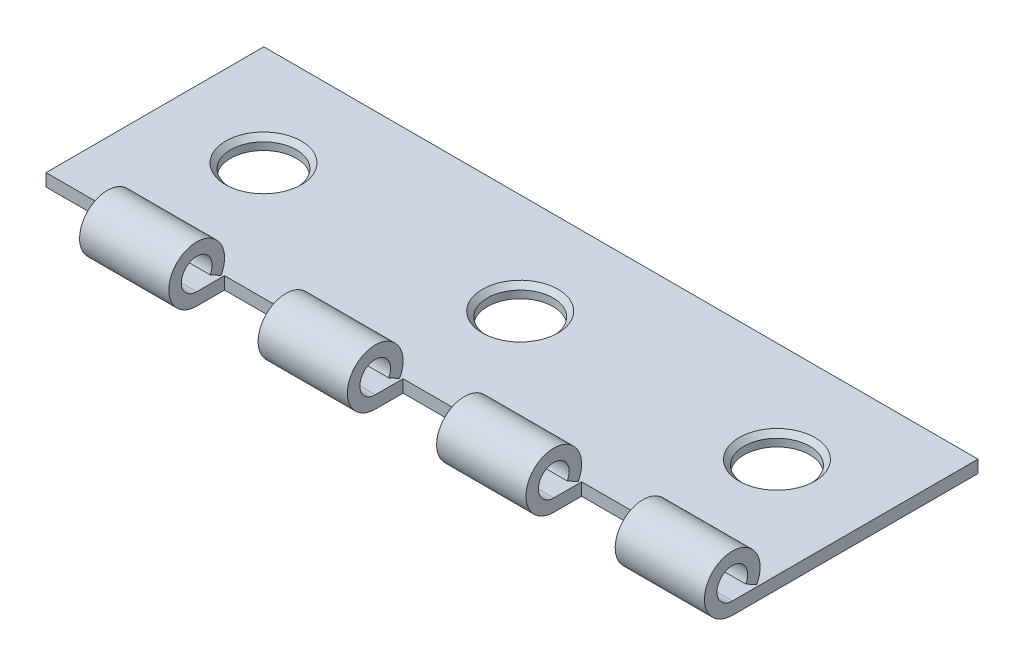
ISO-10303-21;
HEADER;
FILE_DESCRIPTION(('STEP AP214'),'2;1');
FILE_NAME('part.step','',(''),(''),'','','');
FILE_SCHEMA(('AUTOMOTIVE_DESIGN { 1 0 10303 214 1 1 1 1 }'));
ENDSEC;
DATA;
#1=APPLICATION_CONTEXT('core data for automotive mechanical design processes');
#2=APPLICATION_PROTOCOL_DEFINITION('international standard','automotive_design',2000,#1);
#3=PRODUCT_CONTEXT('',#1,'mechanical');
#4=PRODUCT('Part','Part','',(#3));
#5=PRODUCT_RELATED_PRODUCT_CATEGORY('part','',(#4));
#6=PRODUCT_DEFINITION_FORMATION('','',#4);
#7=PRODUCT_DEFINITION_CONTEXT('part definition',#1,'design');
#8=PRODUCT_DEFINITION('design','',#6,#7);
#9=PRODUCT_DEFINITION_SHAPE('','',#8);
#10=(LENGTH_UNIT() NAMED_UNIT(*) SI_UNIT(.MILLI.,.METRE.));
#11=(NAMED_UNIT(*) PLANE_ANGLE_UNIT() SI_UNIT($,.RADIAN.));
#12=(NAMED_UNIT(*) SI_UNIT($,.STERADIAN.) SOLID_ANGLE_UNIT());
#13=UNCERTAINTY_MEASURE_WITH_UNIT(LENGTH_MEASURE(1.E-05),#10,'distance_accuracy_value','');
#14=(GEOMETRIC_REPRESENTATION_CONTEXT(3) GLOBAL_UNCERTAINTY_ASSIGNED_CONTEXT((#13)) GLOBAL_UNIT_ASSIGNED_CONTEXT((#10,
#11,#12)) REPRESENTATION_CONTEXT('',''));
#15=CARTESIAN_POINT('',(0.,0.,0.));
#16=DIRECTION('',(0.,0.,1.));
#17=DIRECTION('',(1.,0.,0.));
#18=AXIS2_PLACEMENT_3D('',#15,#16,#17);
#19=CARTESIAN_POINT('',(-25.4,0.,0.));
#20=DIRECTION('',(1.,0.,0.));
#21=DIRECTION('',(0.,0.,-1.));
#22=AXIS2_PLACEMENT_3D('',#19,#20,#21);
#23=CYLINDRICAL_SURFACE('',#22,1.0922);
#24=DIRECTION('',(1.,0.,0.));
#25=VECTOR('',#24,1.);
#26=CARTESIAN_POINT('',(-25.4,-0.527292872124992,-0.95648474478487));
#27=LINE('',#26,#25);
#28=CARTESIAN_POINT('',(-6.35,-0.527292872124992,-0.95648474478487));
#29=VERTEX_POINT('',#28);
#30=CARTESIAN_POINT('',(0.,-0.527292872124992,-0.95648474478487));
#31=VERTEX_POINT('',#30);
#32=EDGE_CURVE('E379',#29,#31,#27,.T.);
#33=ORIENTED_EDGE('',*,*,#32,.T.);
#34=CARTESIAN_POINT('',(0.,0.,0.));
#35=DIRECTION('',(-1.,0.,0.));
#36=DIRECTION('',(0.,0.,1.));
#37=AXIS2_PLACEMENT_3D('',#34,#35,#36);
#38=CIRCLE('',#37,1.0922);
#39=CARTESIAN_POINT('',(0.,-1.0922,0.));
#40=VERTEX_POINT('',#39);
#41=EDGE_CURVE('E311',#31,#40,#38,.F.);
#42=ORIENTED_EDGE('',*,*,#41,.T.);
#43=DIRECTION('',(1.,0.,0.));
#44=VECTOR('',#43,1.);
#45=CARTESIAN_POINT('',(-25.4,-1.0922,0.));
#46=LINE('',#45,#44);
#47=CARTESIAN_POINT('',(-6.35,-1.0922,0.));
#48=VERTEX_POINT('',#47);
#49=EDGE_CURVE('E398',#48,#40,#46,.T.);
#50=ORIENTED_EDGE('',*,*,#49,.F.);
#51=CARTESIAN_POINT('',(-6.35,0.,0.));
#52=DIRECTION('',(1.,0.,0.));
#53=DIRECTION('',(0.,0.,-1.));
#54=AXIS2_PLACEMENT_3D('',#51,#52,#53);
#55=CIRCLE('',#54,1.0922);
#56=EDGE_CURVE('E275',#48,#29,#55,.F.);
#57=ORIENTED_EDGE('',*,*,#56,.T.);
#58=EDGE_LOOP('',(#33,#42,#50,#57));
#59=FACE_BOUND('',#58,.T.);
#60=ADVANCED_FACE('F36',(#59),#23,.F.);
#61=CARTESIAN_POINT('',(-19.05,-0.527292872124992,-0.95648474478487));
#62=VERTEX_POINT('',#61);
#63=CARTESIAN_POINT('',(-12.7,-0.527292872124992,-0.95648474478487));
#64=VERTEX_POINT('',#63);
#65=EDGE_CURVE('E477',#62,#64,#27,.T.);
#66=ORIENTED_EDGE('',*,*,#65,.T.);
#67=CARTESIAN_POINT('',(-12.7,0.,0.));
#68=DIRECTION('',(-1.,0.,0.));
#69=DIRECTION('',(0.,0.,1.));
#70=AXIS2_PLACEMENT_3D('',#67,#68,#69);
#71=CIRCLE('',#70,1.0922);
#72=CARTESIAN_POINT('',(-12.7,-1.0922,0.));
#73=VERTEX_POINT('',#72);
#74=EDGE_CURVE('E289',#64,#73,#71,.F.);
#75=ORIENTED_EDGE('',*,*,#74,.T.);
#76=CARTESIAN_POINT('',(-19.05,-1.0922,0.));
#77=VERTEX_POINT('',#76);
#78=EDGE_CURVE('E403',#77,#73,#46,.T.);
#79=ORIENTED_EDGE('',*,*,#78,.F.);
#80=CARTESIAN_POINT('',(-19.05,0.,0.));
#81=DIRECTION('',(1.,0.,0.));
#82=DIRECTION('',(0.,0.,-1.));
#83=AXIS2_PLACEMENT_3D('',#80,#81,#82);
#84=CIRCLE('',#83,1.0922);
#85=EDGE_CURVE('E264',#77,#62,#84,.F.);
#86=ORIENTED_EDGE('',*,*,#85,.T.);
#87=EDGE_LOOP('',(#66,#75,#79,#86));
#88=FACE_BOUND('',#87,.T.);
#89=ADVANCED_FACE('F503',(#88),#23,.F.);
#90=CARTESIAN_POINT('',(-25.4,0.,0.));
#91=DIRECTION('',(1.,0.,0.));
#92=DIRECTION('',(0.,0.,-1.));
#93=AXIS2_PLACEMENT_3D('',#90,#91,#92);
#94=CYLINDRICAL_SURFACE('',#93,1.98120000000008);
#95=CARTESIAN_POINT('',(0.,0.,0.));
#96=DIRECTION('',(-1.,0.,0.));
#97=DIRECTION('',(0.,0.,1.));
#98=AXIS2_PLACEMENT_3D('',#95,#96,#97);
#99=CIRCLE('',#98,1.98120000000008);
#100=CARTESIAN_POINT('',(0.,-1.9812,0.));
#101=VERTEX_POINT('',#100);
#102=CARTESIAN_POINT('',(0.,-0.956484744784868,-1.73501883937721));
#103=VERTEX_POINT('',#102);
#104=EDGE_CURVE('E225',#101,#103,#99,.T.);
#105=ORIENTED_EDGE('',*,*,#104,.T.);
#106=DIRECTION('',(1.,0.,0.));
#107=VECTOR('',#106,1.);
#108=CARTESIAN_POINT('',(-25.4,-0.956484744784868,-1.73501883937721));
#109=LINE('',#108,#107);
#110=CARTESIAN_POINT('',(-6.35,-0.956484744784868,-1.73501883937721));
#111=VERTEX_POINT('',#110);
#112=EDGE_CURVE('E382',#111,#103,#109,.T.);
#113=ORIENTED_EDGE('',*,*,#112,.F.);
#114=CARTESIAN_POINT('',(-6.35,0.,0.));
#115=DIRECTION('',(1.,0.,0.));
#116=DIRECTION('',(0.,0.,-1.));
#117=AXIS2_PLACEMENT_3D('',#114,#115,#116);
#118=CIRCLE('',#117,1.98120000000008);
#119=CARTESIAN_POINT('',(-6.35,-1.9812,0.));
#120=VERTEX_POINT('',#119);
#121=EDGE_CURVE('E281',#111,#120,#118,.T.);
#122=ORIENTED_EDGE('',*,*,#121,.T.);
#123=DIRECTION('',(1.,0.,0.));
#124=VECTOR('',#123,1.);
#125=CARTESIAN_POINT('',(-25.4,-1.9812,0.));
#126=LINE('',#125,#124);
#127=EDGE_CURVE('E386',#120,#101,#126,.T.);
#128=ORIENTED_EDGE('',*,*,#127,.T.);
#129=EDGE_LOOP('',(#105,#113,#122,#128));
#130=FACE_BOUND('',#129,.T.);
#131=ADVANCED_FACE('F521',(#130),#94,.T.);
#132=CARTESIAN_POINT('',(-12.7,0.,0.));
#133=DIRECTION('',(-1.,0.,0.));
#134=DIRECTION('',(0.,0.,1.));
#135=AXIS2_PLACEMENT_3D('',#132,#133,#134);
#136=CIRCLE('',#135,1.98120000000008);
#137=CARTESIAN_POINT('',(-12.7,-1.9812,0.));
#138=VERTEX_POINT('',#137);
#139=CARTESIAN_POINT('',(-12.7,-0.956484744784868,-1.73501883937721));
#140=VERTEX_POINT('',#139);
#141=EDGE_CURVE('E295',#138,#140,#136,.T.);
#142=ORIENTED_EDGE('',*,*,#141,.T.);
#143=CARTESIAN_POINT('',(-19.05,-0.956484744784868,-1.73501883937721));
#144=VERTEX_POINT('',#143);
#145=EDGE_CURVE('E485',#144,#140,#109,.T.);
#146=ORIENTED_EDGE('',*,*,#145,.F.);
#147=CARTESIAN_POINT('',(-19.05,0.,0.));
#148=DIRECTION('',(1.,0.,0.));
#149=DIRECTION('',(0.,0.,-1.));
#150=AXIS2_PLACEMENT_3D('',#147,#148,#149);
#151=CIRCLE('',#150,1.98120000000008);
#152=CARTESIAN_POINT('',(-19.05,-1.9812,0.));
#153=VERTEX_POINT('',#152);
#154=EDGE_CURVE('E270',#144,#153,#151,.T.);
#155=ORIENTED_EDGE('',*,*,#154,.T.);
#156=EDGE_CURVE('E392',#153,#138,#126,.T.);
#157=ORIENTED_EDGE('',*,*,#156,.T.);
#158=EDGE_LOOP('',(#142,#146,#155,#157));
#159=FACE_BOUND('',#158,.T.);
#160=ADVANCED_FACE('F523',(#159),#94,.T.);
#161=CARTESIAN_POINT('',(6.35,-0.956484744784868,-1.73501883937721));
#162=VERTEX_POINT('',#161);
#163=CARTESIAN_POINT('',(12.7,-0.956484744784868,-1.73501883937721));
#164=VERTEX_POINT('',#163);
#165=EDGE_CURVE('E380',#162,#164,#109,.T.);
#166=ORIENTED_EDGE('',*,*,#165,.F.);
#167=CARTESIAN_POINT('',(6.35,0.,0.));
#168=DIRECTION('',(1.,0.,0.));
#169=DIRECTION('',(0.,0.,-1.));
#170=AXIS2_PLACEMENT_3D('',#167,#168,#169);
#171=CIRCLE('',#170,1.98120000000008);
#172=CARTESIAN_POINT('',(6.35,-1.9812,0.));
#173=VERTEX_POINT('',#172);
#174=EDGE_CURVE('E306',#162,#173,#171,.T.);
#175=ORIENTED_EDGE('',*,*,#174,.T.);
#176=CARTESIAN_POINT('',(12.7,-1.9812,0.));
#177=VERTEX_POINT('',#176);
#178=EDGE_CURVE('E384',#173,#177,#126,.T.);
#179=ORIENTED_EDGE('',*,*,#178,.T.);
#180=CARTESIAN_POINT('',(12.7,0.,0.));
#181=DIRECTION('',(-1.,0.,0.));
#182=DIRECTION('',(0.,0.,1.));
#183=AXIS2_PLACEMENT_3D('',#180,#181,#182);
#184=CIRCLE('',#183,1.98120000000008);
#185=EDGE_CURVE('E342',#177,#164,#184,.T.);
#186=ORIENTED_EDGE('',*,*,#185,.T.);
#187=EDGE_LOOP('',(#166,#175,#179,#186));
#188=FACE_BOUND('',#187,.T.);
#189=ADVANCED_FACE('F569',(#188),#94,.T.);
#190=CARTESIAN_POINT('',(-25.4,-0.527292872124992,-0.95648474478487));
#191=DIRECTION('',(0.,0.875741388742785,-0.482780509178714));
#192=DIRECTION('',(0.,-0.482780509178714,-0.875741388742785));
#193=AXIS2_PLACEMENT_3D('',#190,#191,#192);
#194=PLANE('',#193);
#195=ORIENTED_EDGE('',*,*,#112,.T.);
#196=DIRECTION('',(0.,0.482780509178714,0.875741388742785));
#197=VECTOR('',#196,1.);
#198=CARTESIAN_POINT('',(0.,-0.527292872124992,-0.95648474478487));
#199=LINE('',#198,#197);
#200=EDGE_CURVE('E314',#103,#31,#199,.T.);
#201=ORIENTED_EDGE('',*,*,#200,.T.);
#202=ORIENTED_EDGE('',*,*,#32,.F.);
#203=DIRECTION('',(0.,-0.482780509178714,-0.875741388742785));
#204=VECTOR('',#203,1.);
#205=CARTESIAN_POINT('',(-6.35,-0.527292872124992,-0.95648474478487));
#206=LINE('',#205,#204);
#207=EDGE_CURVE('E278',#29,#111,#206,.T.);
#208=ORIENTED_EDGE('',*,*,#207,.T.);
#209=EDGE_LOOP('',(#195,#201,#202,#208));
#210=FACE_BOUND('',#209,.T.);
#211=ADVANCED_FACE('F518',(#210),#194,.F.);
#212=ORIENTED_EDGE('',*,*,#145,.T.);
#213=DIRECTION('',(0.,0.482780509178714,0.875741388742785));
#214=VECTOR('',#213,1.);
#215=CARTESIAN_POINT('',(-12.7,-0.527292872124992,-0.95648474478487));
#216=LINE('',#215,#214);
#217=EDGE_CURVE('E292',#140,#64,#216,.T.);
#218=ORIENTED_EDGE('',*,*,#217,.T.);
#219=ORIENTED_EDGE('',*,*,#65,.F.);
#220=DIRECTION('',(0.,-0.482780509178714,-0.875741388742785));
#221=VECTOR('',#220,1.);
#222=CARTESIAN_POINT('',(-19.05,-0.527292872124992,-0.95648474478487));
#223=LINE('',#222,#221);
#224=EDGE_CURVE('E267',#62,#144,#223,.T.);
#225=ORIENTED_EDGE('',*,*,#224,.T.);
#226=EDGE_LOOP('',(#212,#218,#219,#225));
#227=FACE_BOUND('',#226,.T.);
#228=ADVANCED_FACE('F511',(#227),#194,.F.);
#229=CARTESIAN_POINT('',(6.35,-1.0922,0.));
#230=VERTEX_POINT('',#229);
#231=CARTESIAN_POINT('',(12.7,-1.0922,0.));
#232=VERTEX_POINT('',#231);
#233=EDGE_CURVE('E396',#230,#232,#46,.T.);
#234=ORIENTED_EDGE('',*,*,#233,.F.);
#235=CARTESIAN_POINT('',(6.35,0.,0.));
#236=DIRECTION('',(1.,0.,0.));
#237=DIRECTION('',(0.,0.,-1.));
#238=AXIS2_PLACEMENT_3D('',#235,#236,#237);
#239=CIRCLE('',#238,1.0922);
#240=CARTESIAN_POINT('',(6.35,-0.527292872124992,-0.95648474478487));
#241=VERTEX_POINT('',#240);
#242=EDGE_CURVE('E300',#230,#241,#239,.F.);
#243=ORIENTED_EDGE('',*,*,#242,.T.);
#244=CARTESIAN_POINT('',(12.7,-0.527292872124992,-0.95648474478487));
#245=VERTEX_POINT('',#244);
#246=EDGE_CURVE('E377',#241,#245,#27,.T.);
#247=ORIENTED_EDGE('',*,*,#246,.T.);
#248=CARTESIAN_POINT('',(12.7,0.,0.));
#249=DIRECTION('',(-1.,0.,0.));
#250=DIRECTION('',(0.,0.,1.));
#251=AXIS2_PLACEMENT_3D('',#248,#249,#250);
#252=CIRCLE('',#251,1.0922);
#253=EDGE_CURVE('E341',#245,#232,#252,.F.);
#254=ORIENTED_EDGE('',*,*,#253,.T.);
#255=EDGE_LOOP('',(#234,#243,#247,#254));
#256=FACE_BOUND('',#255,.T.);
#257=ADVANCED_FACE('F540',(#256),#23,.F.);
#258=ORIENTED_EDGE('',*,*,#246,.F.);
#259=DIRECTION('',(0.,-0.482780509178714,-0.875741388742785));
#260=VECTOR('',#259,1.);
#261=CARTESIAN_POINT('',(6.35,-0.527292872124992,-0.95648474478487));
#262=LINE('',#261,#260);
#263=EDGE_CURVE('E303',#241,#162,#262,.T.);
#264=ORIENTED_EDGE('',*,*,#263,.T.);
#265=ORIENTED_EDGE('',*,*,#165,.T.);
#266=DIRECTION('',(0.,0.482780509178714,0.875741388742785));
#267=VECTOR('',#266,1.);
#268=CARTESIAN_POINT('',(12.7,-0.527292872124992,-0.95648474478487));
#269=LINE('',#268,#267);
#270=EDGE_CURVE('E402',#164,#245,#269,.T.);
#271=ORIENTED_EDGE('',*,*,#270,.T.);
#272=EDGE_LOOP('',(#258,#264,#265,#271));
#273=FACE_BOUND('',#272,.T.);
#274=ADVANCED_FACE('F542',(#273),#194,.F.);
#275=CARTESIAN_POINT('',(19.05,-1.0922,0.));
#276=VERTEX_POINT('',#275);
#277=CARTESIAN_POINT('',(25.4,-1.0922,0.));
#278=VERTEX_POINT('',#277);
#279=EDGE_CURVE('E395',#276,#278,#46,.T.);
#280=ORIENTED_EDGE('',*,*,#279,.F.);
#281=CARTESIAN_POINT('',(19.05,0.,0.));
#282=DIRECTION('',(1.,0.,0.));
#283=DIRECTION('',(0.,0.,-1.));
#284=AXIS2_PLACEMENT_3D('',#281,#282,#283);
#285=CIRCLE('',#284,1.0922);
#286=CARTESIAN_POINT('',(19.05,-0.527292872124992,-0.95648474478487));
#287=VERTEX_POINT('',#286);
#288=EDGE_CURVE('E331',#276,#287,#285,.F.);
#289=ORIENTED_EDGE('',*,*,#288,.T.);
#290=CARTESIAN_POINT('',(25.4,-0.527292872124992,-0.95648474478487));
#291=VERTEX_POINT('',#290);
#292=EDGE_CURVE('E362',#287,#291,#27,.T.);
#293=ORIENTED_EDGE('',*,*,#292,.T.);
#294=CARTESIAN_POINT('',(25.4,0.,0.));
#295=DIRECTION('',(1.,0.,0.));
#296=DIRECTION('',(0.,0.,-1.));
#297=AXIS2_PLACEMENT_3D('',#294,#295,#296);
#298=CIRCLE('',#297,1.0922);
#299=EDGE_CURVE('E353',#291,#278,#298,.T.);
#300=ORIENTED_EDGE('',*,*,#299,.T.);
#301=EDGE_LOOP('',(#280,#289,#293,#300));
#302=FACE_BOUND('',#301,.T.);
#303=ADVANCED_FACE('F38',(#302),#23,.F.);
#304=CARTESIAN_POINT('',(-25.4,-1.09219999999999,-17.4752));
#305=DIRECTION('',(0.,-1.,0.));
#306=DIRECTION('',(0.,0.,1.));
#307=AXIS2_PLACEMENT_3D('',#304,#305,#306);
#308=PLANE('',#307);
#309=CARTESIAN_POINT('',(-18.2626,-1.09219999999999,-10.3124));
#310=DIRECTION('',(0.,1.,0.));
#311=DIRECTION('',(0.,0.,-1.));
#312=AXIS2_PLACEMENT_3D('',#309,#310,#311);
#313=CIRCLE('',#312,2.6924);
#314=CARTESIAN_POINT('',(-18.2626,-1.09219999999999,-13.0048));
#315=VERTEX_POINT('',#314);
#316=EDGE_CURVE('E251',#315,#315,#313,.T.);
#317=ORIENTED_EDGE('',*,*,#316,.F.);
#318=EDGE_LOOP('',(#317));
#319=FACE_BOUND('',#318,.T.);
#320=CARTESIAN_POINT('',(0.,-1.09219999999999,-10.3124));
#321=DIRECTION('',(0.,1.,0.));
#322=DIRECTION('',(0.,0.,-1.));
#323=AXIS2_PLACEMENT_3D('',#320,#321,#322);
#324=CIRCLE('',#323,2.6924);
#325=CARTESIAN_POINT('',(0.,-1.09219999999999,-13.0048));
#326=VERTEX_POINT('',#325);
#327=EDGE_CURVE('E420',#326,#326,#324,.T.);
#328=ORIENTED_EDGE('',*,*,#327,.F.);
#329=EDGE_LOOP('',(#328));
#330=FACE_BOUND('',#329,.T.);
#331=CARTESIAN_POINT('',(18.2626,-1.09219999999999,-10.3124));
#332=DIRECTION('',(0.,1.,0.));
#333=DIRECTION('',(0.,0.,-1.));
#334=AXIS2_PLACEMENT_3D('',#331,#332,#333);
#335=CIRCLE('',#334,2.6924);
#336=CARTESIAN_POINT('',(18.2626,-1.09219999999999,-13.0048));
#337=VERTEX_POINT('',#336);
#338=EDGE_CURVE('E416',#337,#337,#335,.T.);
#339=ORIENTED_EDGE('',*,*,#338,.F.);
#340=EDGE_LOOP('',(#339));
#341=FACE_BOUND('',#340,.T.);
#342=ORIENTED_EDGE('',*,*,#49,.T.);
#343=DIRECTION('',(0.,0.,-1.));
#344=VECTOR('',#343,1.);
#345=CARTESIAN_POINT('',(0.,-1.09219999999999,-17.4752));
#346=LINE('',#345,#344);
#347=CARTESIAN_POINT('',(0.,-1.0922,-1.98120000000012));
#348=VERTEX_POINT('',#347);
#349=EDGE_CURVE('E309',#40,#348,#346,.T.);
#350=ORIENTED_EDGE('',*,*,#349,.T.);
#351=DIRECTION('',(1.,0.,0.));
#352=VECTOR('',#351,1.);
#353=CARTESIAN_POINT('',(-25.4,-1.0922,-1.98120000000012));
#354=LINE('',#353,#352);
#355=CARTESIAN_POINT('',(6.35,-1.0922,-1.98120000000012));
#356=VERTEX_POINT('',#355);
#357=EDGE_CURVE('E215',#348,#356,#354,.T.);
#358=ORIENTED_EDGE('',*,*,#357,.T.);
#359=DIRECTION('',(0.,0.,1.));
#360=VECTOR('',#359,1.);
#361=CARTESIAN_POINT('',(6.35,-1.09219999999999,-17.4752));
#362=LINE('',#361,#360);
#363=EDGE_CURVE('E297',#356,#230,#362,.T.);
#364=ORIENTED_EDGE('',*,*,#363,.T.);
#365=ORIENTED_EDGE('',*,*,#233,.T.);
#366=DIRECTION('',(0.,0.,-1.));
#367=VECTOR('',#366,1.);
#368=CARTESIAN_POINT('',(12.7,-1.09219999999999,-17.4752));
#369=LINE('',#368,#367);
#370=CARTESIAN_POINT('',(12.7,-1.0922,-1.98120000000012));
#371=VERTEX_POINT('',#370);
#372=EDGE_CURVE('E345',#232,#371,#369,.T.);
#373=ORIENTED_EDGE('',*,*,#372,.T.);
#374=DIRECTION('',(1.,0.,0.));
#375=VECTOR('',#374,1.);
#376=CARTESIAN_POINT('',(-25.4,-1.0922,-1.98120000000011));
#377=LINE('',#376,#375);
#378=CARTESIAN_POINT('',(19.05,-1.0922,-1.98120000000012));
#379=VERTEX_POINT('',#378);
#380=EDGE_CURVE('E350',#371,#379,#377,.T.);
#381=ORIENTED_EDGE('',*,*,#380,.T.);
#382=DIRECTION('',(0.,0.,1.));
#383=VECTOR('',#382,1.);
#384=CARTESIAN_POINT('',(19.05,-1.09219999999999,-17.4752));
#385=LINE('',#384,#383);
#386=EDGE_CURVE('E336',#379,#276,#385,.T.);
#387=ORIENTED_EDGE('',*,*,#386,.T.);
#388=ORIENTED_EDGE('',*,*,#279,.T.);
#389=DIRECTION('',(0.,0.,-1.));
#390=VECTOR('',#389,1.);
#391=CARTESIAN_POINT('',(25.4,-1.09219999999999,-17.4752));
#392=LINE('',#391,#390);
#393=CARTESIAN_POINT('',(25.4,-1.09219999999999,-17.4752));
#394=VERTEX_POINT('',#393);
#395=EDGE_CURVE('E365',#278,#394,#392,.T.);
#396=ORIENTED_EDGE('',*,*,#395,.T.);
#397=DIRECTION('',(1.,0.,0.));
#398=VECTOR('',#397,1.);
#399=CARTESIAN_POINT('',(-25.4,-1.09219999999999,-17.4752));
#400=LINE('',#399,#398);
#401=CARTESIAN_POINT('',(-25.4,-1.09219999999999,-17.4752));
#402=VERTEX_POINT('',#401);
#403=EDGE_CURVE('E391',#402,#394,#400,.T.);
#404=ORIENTED_EDGE('',*,*,#403,.F.);
#405=DIRECTION('',(0.,0.,-1.));
#406=VECTOR('',#405,1.);
#407=CARTESIAN_POINT('',(-25.4,-1.09219999999999,-17.4752));
#408=LINE('',#407,#406);
#409=CARTESIAN_POINT('',(-25.4,-1.0922,-1.98120000000012));
#410=VERTEX_POINT('',#409);
#411=EDGE_CURVE('E354',#410,#402,#408,.T.);
#412=ORIENTED_EDGE('',*,*,#411,.F.);
#413=DIRECTION('',(1.,0.,0.));
#414=VECTOR('',#413,1.);
#415=CARTESIAN_POINT('',(-25.4,-1.0922,-1.98120000000012));
#416=LINE('',#415,#414);
#417=CARTESIAN_POINT('',(-19.05,-1.0922,-1.98120000000012));
#418=VERTEX_POINT('',#417);
#419=EDGE_CURVE('E218',#410,#418,#416,.T.);
#420=ORIENTED_EDGE('',*,*,#419,.T.);
#421=DIRECTION('',(0.,0.,1.));
#422=VECTOR('',#421,1.);
#423=CARTESIAN_POINT('',(-19.05,-1.09219999999999,-17.4752));
#424=LINE('',#423,#422);
#425=EDGE_CURVE('E261',#418,#77,#424,.T.);
#426=ORIENTED_EDGE('',*,*,#425,.T.);
#427=ORIENTED_EDGE('',*,*,#78,.T.);
#428=DIRECTION('',(0.,0.,-1.));
#429=VECTOR('',#428,1.);
#430=CARTESIAN_POINT('',(-12.7,-1.09219999999999,-17.4752));
#431=LINE('',#430,#429);
#432=CARTESIAN_POINT('',(-12.7,-1.0922,-1.98120000000012));
#433=VERTEX_POINT('',#432);
#434=EDGE_CURVE('E286',#73,#433,#431,.T.);
#435=ORIENTED_EDGE('',*,*,#434,.T.);
#436=DIRECTION('',(1.,0.,0.));
#437=VECTOR('',#436,1.);
#438=CARTESIAN_POINT('',(-25.4,-1.0922,-1.98120000000012));
#439=LINE('',#438,#437);
#440=CARTESIAN_POINT('',(-6.35,-1.0922,-1.98120000000012));
#441=VERTEX_POINT('',#440);
#442=EDGE_CURVE('E283',#433,#441,#439,.T.);
#443=ORIENTED_EDGE('',*,*,#442,.T.);
#444=DIRECTION('',(0.,0.,1.));
#445=VECTOR('',#444,1.);
#446=CARTESIAN_POINT('',(-6.35,-1.09219999999999,-17.4752));
#447=LINE('',#446,#445);
#448=EDGE_CURVE('E272',#441,#48,#447,.T.);
#449=ORIENTED_EDGE('',*,*,#448,.T.);
#450=EDGE_LOOP('',(#342,#350,#358,#364,#365,#373,#381,#387,#388,#396,#404,#412,#420,#426,#427,
#435,#443,#449));
#451=FACE_BOUND('',#450,.T.);
#452=ADVANCED_FACE('F453',(#319,#330,#341,#451),#308,.F.);
#453=CARTESIAN_POINT('',(-25.4,-1.98119999999999,-17.4752));
#454=DIRECTION('',(0.,0.,1.));
#455=DIRECTION('',(1.,0.,0.));
#456=AXIS2_PLACEMENT_3D('',#453,#454,#455);
#457=PLANE('',#456);
#458=DIRECTION('',(0.,-1.,0.));
#459=VECTOR('',#458,1.);
#460=CARTESIAN_POINT('',(25.4,-1.98119999999999,-17.4752));
#461=LINE('',#460,#459);
#462=CARTESIAN_POINT('',(25.4,-1.98119999999999,-17.4752));
#463=VERTEX_POINT('',#462);
#464=EDGE_CURVE('E367',#394,#463,#461,.T.);
#465=ORIENTED_EDGE('',*,*,#464,.T.);
#466=DIRECTION('',(1.,0.,0.));
#467=VECTOR('',#466,1.);
#468=CARTESIAN_POINT('',(-25.4,-1.98119999999999,-17.4752));
#469=LINE('',#468,#467);
#470=CARTESIAN_POINT('',(-25.4,-1.98119999999999,-17.4752));
#471=VERTEX_POINT('',#470);
#472=EDGE_CURVE('E388',#471,#463,#469,.T.);
#473=ORIENTED_EDGE('',*,*,#472,.F.);
#474=DIRECTION('',(0.,-1.,0.));
#475=VECTOR('',#474,1.);
#476=CARTESIAN_POINT('',(-25.4,-1.98119999999999,-17.4752));
#477=LINE('',#476,#475);
#478=EDGE_CURVE('E356',#402,#471,#477,.T.);
#479=ORIENTED_EDGE('',*,*,#478,.F.);
#480=ORIENTED_EDGE('',*,*,#403,.T.);
#481=EDGE_LOOP('',(#465,#473,#479,#480));
#482=FACE_BOUND('',#481,.T.);
#483=ADVANCED_FACE('F456',(#482),#457,.F.);
#484=CARTESIAN_POINT('',(-25.4,-1.9812,0.));
#485=DIRECTION('',(0.,1.,0.));
#486=DIRECTION('',(0.,0.,-1.));
#487=AXIS2_PLACEMENT_3D('',#484,#485,#486);
#488=PLANE('',#487);
#489=CARTESIAN_POINT('',(-18.2626,-1.9812,-10.3124));
#490=DIRECTION('',(0.,1.,0.));
#491=DIRECTION('',(0.,0.,-1.));
#492=AXIS2_PLACEMENT_3D('',#489,#490,#491);
#493=CIRCLE('',#492,2.3368);
#494=CARTESIAN_POINT('',(-18.2626,-1.98119999999999,-12.6492));
#495=VERTEX_POINT('',#494);
#496=EDGE_CURVE('E411',#495,#495,#493,.T.);
#497=ORIENTED_EDGE('',*,*,#496,.T.);
#498=EDGE_LOOP('',(#497));
#499=FACE_BOUND('',#498,.T.);
#500=CARTESIAN_POINT('',(0.,-1.9812,-10.3124));
#501=DIRECTION('',(0.,1.,0.));
#502=DIRECTION('',(0.,0.,-1.));
#503=AXIS2_PLACEMENT_3D('',#500,#501,#502);
#504=CIRCLE('',#503,2.3368);
#505=CARTESIAN_POINT('',(0.,-1.98119999999999,-12.6492));
#506=VERTEX_POINT('',#505);
#507=EDGE_CURVE('E431',#506,#506,#504,.T.);
#508=ORIENTED_EDGE('',*,*,#507,.T.);
#509=EDGE_LOOP('',(#508));
#510=FACE_BOUND('',#509,.T.);
#511=CARTESIAN_POINT('',(18.2626,-1.9812,-10.3124));
#512=DIRECTION('',(0.,1.,0.));
#513=DIRECTION('',(0.,0.,-1.));
#514=AXIS2_PLACEMENT_3D('',#511,#512,#513);
#515=CIRCLE('',#514,2.3368);
#516=CARTESIAN_POINT('',(18.2626,-1.98119999999999,-12.6492));
#517=VERTEX_POINT('',#516);
#518=EDGE_CURVE('E428',#517,#517,#515,.T.);
#519=ORIENTED_EDGE('',*,*,#518,.T.);
#520=EDGE_LOOP('',(#519));
#521=FACE_BOUND('',#520,.T.);
#522=DIRECTION('',(-1.,0.,0.));
#523=VECTOR('',#522,1.);
#524=CARTESIAN_POINT('',(0.,-1.9812,-1.98120000000012));
#525=LINE('',#524,#523);
#526=CARTESIAN_POINT('',(6.35,-1.9812,-1.98120000000012));
#527=VERTEX_POINT('',#526);
#528=CARTESIAN_POINT('',(0.,-1.9812,-1.98120000000012));
#529=VERTEX_POINT('',#528);
#530=EDGE_CURVE('E53',#527,#529,#525,.T.);
#531=ORIENTED_EDGE('',*,*,#530,.T.);
#532=DIRECTION('',(0.,0.,1.));
#533=VECTOR('',#532,1.);
#534=CARTESIAN_POINT('',(0.,-1.9812,1.98120000000012));
#535=LINE('',#534,#533);
#536=EDGE_CURVE('E222',#529,#101,#535,.T.);
#537=ORIENTED_EDGE('',*,*,#536,.T.);
#538=ORIENTED_EDGE('',*,*,#127,.F.);
#539=DIRECTION('',(0.,0.,-1.));
#540=VECTOR('',#539,1.);
#541=CARTESIAN_POINT('',(-6.35,-1.9812,0.));
#542=LINE('',#541,#540);
#543=CARTESIAN_POINT('',(-6.35,-1.9812,-1.98120000000012));
#544=VERTEX_POINT('',#543);
#545=EDGE_CURVE('E45',#120,#544,#542,.T.);
#546=ORIENTED_EDGE('',*,*,#545,.T.);
#547=DIRECTION('',(-1.,0.,0.));
#548=VECTOR('',#547,1.);
#549=CARTESIAN_POINT('',(-12.7,-1.9812,-1.98120000000012));
#550=LINE('',#549,#548);
#551=CARTESIAN_POINT('',(-12.7,-1.9812,-1.98120000000012));
#552=VERTEX_POINT('',#551);
#553=EDGE_CURVE('E61',#544,#552,#550,.T.);
#554=ORIENTED_EDGE('',*,*,#553,.T.);
#555=DIRECTION('',(0.,0.,1.));
#556=VECTOR('',#555,1.);
#557=CARTESIAN_POINT('',(-12.7,-1.9812,1.98120000000012));
#558=LINE('',#557,#556);
#559=EDGE_CURVE('E238',#552,#138,#558,.T.);
#560=ORIENTED_EDGE('',*,*,#559,.T.);
#561=ORIENTED_EDGE('',*,*,#156,.F.);
#562=DIRECTION('',(0.,0.,-1.));
#563=VECTOR('',#562,1.);
#564=CARTESIAN_POINT('',(-19.05,-1.9812,-1.98120000000012));
#565=LINE('',#564,#563);
#566=CARTESIAN_POINT('',(-19.05,-1.9812,-1.98120000000012));
#567=VERTEX_POINT('',#566);
#568=EDGE_CURVE('E247',#153,#567,#565,.T.);
#569=ORIENTED_EDGE('',*,*,#568,.T.);
#570=DIRECTION('',(-1.,0.,0.));
#571=VECTOR('',#570,1.);
#572=CARTESIAN_POINT('',(-25.4,-1.9812,-1.98120000000012));
#573=LINE('',#572,#571);
#574=CARTESIAN_POINT('',(-25.4,-1.9812,-1.98120000000012));
#575=VERTEX_POINT('',#574);
#576=EDGE_CURVE('E250',#567,#575,#573,.T.);
#577=ORIENTED_EDGE('',*,*,#576,.T.);
#578=DIRECTION('',(0.,0.,1.));
#579=VECTOR('',#578,1.);
#580=CARTESIAN_POINT('',(-25.4,-1.9812,0.));
#581=LINE('',#580,#579);
#582=EDGE_CURVE('E359',#471,#575,#581,.T.);
#583=ORIENTED_EDGE('',*,*,#582,.F.);
#584=ORIENTED_EDGE('',*,*,#472,.T.);
#585=DIRECTION('',(0.,0.,1.));
#586=VECTOR('',#585,1.);
#587=CARTESIAN_POINT('',(25.4,-1.9812,0.));
#588=LINE('',#587,#586);
#589=CARTESIAN_POINT('',(25.4,-1.9812,0.));
#590=VERTEX_POINT('',#589);
#591=EDGE_CURVE('E369',#463,#590,#588,.T.);
#592=ORIENTED_EDGE('',*,*,#591,.T.);
#593=CARTESIAN_POINT('',(19.05,-1.9812,0.));
#594=VERTEX_POINT('',#593);
#595=EDGE_CURVE('E387',#594,#590,#126,.T.);
#596=ORIENTED_EDGE('',*,*,#595,.F.);
#597=DIRECTION('',(0.,0.,-1.));
#598=VECTOR('',#597,1.);
#599=CARTESIAN_POINT('',(19.05,-1.9812,-1.98120000000012));
#600=LINE('',#599,#598);
#601=CARTESIAN_POINT('',(19.05,-1.9812,-1.98120000000012));
#602=VERTEX_POINT('',#601);
#603=EDGE_CURVE('E321',#594,#602,#600,.T.);
#604=ORIENTED_EDGE('',*,*,#603,.T.);
#605=DIRECTION('',(-1.,0.,0.));
#606=VECTOR('',#605,1.);
#607=CARTESIAN_POINT('',(12.7,-1.9812,-1.98120000000012));
#608=LINE('',#607,#606);
#609=CARTESIAN_POINT('',(12.7,-1.9812,-1.98120000000012));
#610=VERTEX_POINT('',#609);
#611=EDGE_CURVE('E324',#602,#610,#608,.T.);
#612=ORIENTED_EDGE('',*,*,#611,.T.);
#613=DIRECTION('',(0.,0.,1.));
#614=VECTOR('',#613,1.);
#615=CARTESIAN_POINT('',(12.7,-1.9812,1.98120000000012));
#616=LINE('',#615,#614);
#617=EDGE_CURVE('E318',#610,#177,#616,.T.);
#618=ORIENTED_EDGE('',*,*,#617,.T.);
#619=ORIENTED_EDGE('',*,*,#178,.F.);
#620=DIRECTION('',(0.,0.,-1.));
#621=VECTOR('',#620,1.);
#622=CARTESIAN_POINT('',(6.35,-1.9812,0.));
#623=LINE('',#622,#621);
#624=EDGE_CURVE('E11',#173,#527,#623,.T.);
#625=ORIENTED_EDGE('',*,*,#624,.T.);
#626=EDGE_LOOP('',(#531,#537,#538,#546,#554,#560,#561,#569,#577,#583,#584,#592,#596,#604,#612,
#618,#619,#625));
#627=FACE_BOUND('',#626,.T.);
#628=ADVANCED_FACE('F231',(#499,#510,#521,#627),#488,.F.);
#629=CARTESIAN_POINT('',(19.05,-0.956484744784868,-1.73501883937721));
#630=VERTEX_POINT('',#629);
#631=CARTESIAN_POINT('',(25.4,-0.956484744784868,-1.73501883937721));
#632=VERTEX_POINT('',#631);
#633=EDGE_CURVE('E383',#630,#632,#109,.T.);
#634=ORIENTED_EDGE('',*,*,#633,.F.);
#635=CARTESIAN_POINT('',(19.05,0.,0.));
#636=DIRECTION('',(1.,0.,0.));
#637=DIRECTION('',(0.,0.,-1.));
#638=AXIS2_PLACEMENT_3D('',#635,#636,#637);
#639=CIRCLE('',#638,1.98120000000008);
#640=EDGE_CURVE('E334',#630,#594,#639,.T.);
#641=ORIENTED_EDGE('',*,*,#640,.T.);
#642=ORIENTED_EDGE('',*,*,#595,.T.);
#643=CARTESIAN_POINT('',(25.4,0.,0.));
#644=DIRECTION('',(-1.,0.,0.));
#645=DIRECTION('',(0.,0.,-1.));
#646=AXIS2_PLACEMENT_3D('',#643,#644,#645);
#647=CIRCLE('',#646,1.98120000000008);
#648=EDGE_CURVE('E372',#590,#632,#647,.T.);
#649=ORIENTED_EDGE('',*,*,#648,.T.);
#650=EDGE_LOOP('',(#634,#641,#642,#649));
#651=FACE_BOUND('',#650,.T.);
#652=ADVANCED_FACE('F482',(#651),#94,.T.);
#653=ORIENTED_EDGE('',*,*,#292,.F.);
#654=DIRECTION('',(0.,-0.482780509178714,-0.875741388742785));
#655=VECTOR('',#654,1.);
#656=CARTESIAN_POINT('',(19.05,-0.527292872124992,-0.95648474478487));
#657=LINE('',#656,#655);
#658=EDGE_CURVE('E399',#287,#630,#657,.T.);
#659=ORIENTED_EDGE('',*,*,#658,.T.);
#660=ORIENTED_EDGE('',*,*,#633,.T.);
#661=DIRECTION('',(0.,0.482780509178714,0.875741388742785));
#662=VECTOR('',#661,1.);
#663=CARTESIAN_POINT('',(25.4,-0.527292872124992,-0.95648474478487));
#664=LINE('',#663,#662);
#665=EDGE_CURVE('E357',#632,#291,#664,.T.);
#666=ORIENTED_EDGE('',*,*,#665,.T.);
#667=EDGE_LOOP('',(#653,#659,#660,#666));
#668=FACE_BOUND('',#667,.T.);
#669=ADVANCED_FACE('F478',(#668),#194,.F.);
#670=CARTESIAN_POINT('',(-25.4,0.,0.));
#671=DIRECTION('',(1.,0.,0.));
#672=DIRECTION('',(0.,0.,-1.));
#673=AXIS2_PLACEMENT_3D('',#670,#671,#672);
#674=PLANE('',#673);
#675=ORIENTED_EDGE('',*,*,#582,.T.);
#676=DIRECTION('',(0.,1.,0.));
#677=VECTOR('',#676,1.);
#678=CARTESIAN_POINT('',(-25.4,-1.9812,-1.98120000000012));
#679=LINE('',#678,#677);
#680=EDGE_CURVE('E241',#575,#410,#679,.T.);
#681=ORIENTED_EDGE('',*,*,#680,.T.);
#682=ORIENTED_EDGE('',*,*,#411,.T.);
#683=ORIENTED_EDGE('',*,*,#478,.T.);
#684=EDGE_LOOP('',(#675,#681,#682,#683));
#685=FACE_BOUND('',#684,.T.);
#686=ADVANCED_FACE('F492',(#685),#674,.F.);
#687=CARTESIAN_POINT('',(25.4,0.,0.));
#688=DIRECTION('',(1.,0.,0.));
#689=DIRECTION('',(0.,0.,-1.));
#690=AXIS2_PLACEMENT_3D('',#687,#688,#689);
#691=PLANE('',#690);
#692=ORIENTED_EDGE('',*,*,#299,.F.);
#693=ORIENTED_EDGE('',*,*,#665,.F.);
#694=ORIENTED_EDGE('',*,*,#648,.F.);
#695=ORIENTED_EDGE('',*,*,#591,.F.);
#696=ORIENTED_EDGE('',*,*,#464,.F.);
#697=ORIENTED_EDGE('',*,*,#395,.F.);
#698=EDGE_LOOP('',(#692,#693,#694,#695,#696,#697));
#699=FACE_BOUND('',#698,.T.);
#700=ADVANCED_FACE('F472',(#699),#691,.T.);
#701=CARTESIAN_POINT('',(12.7,-1.9812,-1.98120000000012));
#702=DIRECTION('',(0.,0.,-1.));
#703=DIRECTION('',(-1.,0.,0.));
#704=AXIS2_PLACEMENT_3D('',#701,#702,#703);
#705=PLANE('',#704);
#706=DIRECTION('',(0.,1.,0.));
#707=VECTOR('',#706,1.);
#708=CARTESIAN_POINT('',(12.7,-1.9812,-1.98120000000012));
#709=LINE('',#708,#707);
#710=EDGE_CURVE('E328',#610,#371,#709,.T.);
#711=ORIENTED_EDGE('',*,*,#710,.F.);
#712=ORIENTED_EDGE('',*,*,#611,.F.);
#713=DIRECTION('',(0.,1.,0.));
#714=VECTOR('',#713,1.);
#715=CARTESIAN_POINT('',(19.05,-1.9812,-1.98120000000012));
#716=LINE('',#715,#714);
#717=EDGE_CURVE('E327',#602,#379,#716,.T.);
#718=ORIENTED_EDGE('',*,*,#717,.T.);
#719=ORIENTED_EDGE('',*,*,#380,.F.);
#720=EDGE_LOOP('',(#711,#712,#718,#719));
#721=FACE_BOUND('',#720,.T.);
#722=ADVANCED_FACE('F564',(#721),#705,.F.);
#723=CARTESIAN_POINT('',(12.7,-1.9812,1.98120000000012));
#724=DIRECTION('',(-1.,0.,0.));
#725=DIRECTION('',(0.,0.,1.));
#726=AXIS2_PLACEMENT_3D('',#723,#724,#725);
#727=PLANE('',#726);
#728=ORIENTED_EDGE('',*,*,#253,.F.);
#729=ORIENTED_EDGE('',*,*,#270,.F.);
#730=ORIENTED_EDGE('',*,*,#185,.F.);
#731=ORIENTED_EDGE('',*,*,#617,.F.);
#732=ORIENTED_EDGE('',*,*,#710,.T.);
#733=ORIENTED_EDGE('',*,*,#372,.F.);
#734=EDGE_LOOP('',(#728,#729,#730,#731,#732,#733));
#735=FACE_BOUND('',#734,.T.);
#736=ADVANCED_FACE('F558',(#735),#727,.F.);
#737=CARTESIAN_POINT('',(19.05,-1.9812,-1.98120000000012));
#738=DIRECTION('',(1.,0.,0.));
#739=DIRECTION('',(0.,0.,-1.));
#740=AXIS2_PLACEMENT_3D('',#737,#738,#739);
#741=PLANE('',#740);
#742=ORIENTED_EDGE('',*,*,#640,.F.);
#743=ORIENTED_EDGE('',*,*,#658,.F.);
#744=ORIENTED_EDGE('',*,*,#288,.F.);
#745=ORIENTED_EDGE('',*,*,#386,.F.);
#746=ORIENTED_EDGE('',*,*,#717,.F.);
#747=ORIENTED_EDGE('',*,*,#603,.F.);
#748=EDGE_LOOP('',(#742,#743,#744,#745,#746,#747));
#749=FACE_BOUND('',#748,.T.);
#750=ADVANCED_FACE('F566',(#749),#741,.F.);
#751=CARTESIAN_POINT('',(-19.05,-1.9812,-1.98120000000012));
#752=DIRECTION('',(1.,0.,0.));
#753=DIRECTION('',(0.,0.,-1.));
#754=AXIS2_PLACEMENT_3D('',#751,#752,#753);
#755=PLANE('',#754);
#756=ORIENTED_EDGE('',*,*,#154,.F.);
#757=ORIENTED_EDGE('',*,*,#224,.F.);
#758=ORIENTED_EDGE('',*,*,#85,.F.);
#759=ORIENTED_EDGE('',*,*,#425,.F.);
#760=DIRECTION('',(0.,1.,0.));
#761=VECTOR('',#760,1.);
#762=CARTESIAN_POINT('',(-19.05,-1.9812,-1.98120000000012));
#763=LINE('',#762,#761);
#764=EDGE_CURVE('E254',#567,#418,#763,.T.);
#765=ORIENTED_EDGE('',*,*,#764,.F.);
#766=ORIENTED_EDGE('',*,*,#568,.F.);
#767=EDGE_LOOP('',(#756,#757,#758,#759,#765,#766));
#768=FACE_BOUND('',#767,.T.);
#769=ADVANCED_FACE('F500',(#768),#755,.F.);
#770=CARTESIAN_POINT('',(-25.4,-1.9812,-1.98120000000012));
#771=DIRECTION('',(0.,0.,-1.));
#772=DIRECTION('',(-1.,0.,0.));
#773=AXIS2_PLACEMENT_3D('',#770,#771,#772);
#774=PLANE('',#773);
#775=ORIENTED_EDGE('',*,*,#680,.F.);
#776=ORIENTED_EDGE('',*,*,#576,.F.);
#777=ORIENTED_EDGE('',*,*,#764,.T.);
#778=ORIENTED_EDGE('',*,*,#419,.F.);
#779=EDGE_LOOP('',(#775,#776,#777,#778));
#780=FACE_BOUND('',#779,.T.);
#781=ADVANCED_FACE('F495',(#780),#774,.F.);
#782=CARTESIAN_POINT('',(-12.7,-1.9812,1.98120000000012));
#783=DIRECTION('',(-1.,0.,0.));
#784=DIRECTION('',(0.,0.,1.));
#785=AXIS2_PLACEMENT_3D('',#782,#783,#784);
#786=PLANE('',#785);
#787=ORIENTED_EDGE('',*,*,#559,.F.);
#788=DIRECTION('',(0.,1.,0.));
#789=VECTOR('',#788,1.);
#790=CARTESIAN_POINT('',(-12.7,-1.9812,-1.98120000000012));
#791=LINE('',#790,#789);
#792=EDGE_CURVE('E229',#552,#433,#791,.T.);
#793=ORIENTED_EDGE('',*,*,#792,.T.);
#794=ORIENTED_EDGE('',*,*,#434,.F.);
#795=ORIENTED_EDGE('',*,*,#74,.F.);
#796=ORIENTED_EDGE('',*,*,#217,.F.);
#797=ORIENTED_EDGE('',*,*,#141,.F.);
#798=EDGE_LOOP('',(#787,#793,#794,#795,#796,#797));
#799=FACE_BOUND('',#798,.T.);
#800=ADVANCED_FACE('F508',(#799),#786,.F.);
#801=CARTESIAN_POINT('',(-12.7,-1.9812,-1.98120000000012));
#802=DIRECTION('',(0.,0.,-1.));
#803=DIRECTION('',(-1.,0.,0.));
#804=AXIS2_PLACEMENT_3D('',#801,#802,#803);
#805=PLANE('',#804);
#806=ORIENTED_EDGE('',*,*,#792,.F.);
#807=ORIENTED_EDGE('',*,*,#553,.F.);
#808=DIRECTION('',(0.,1.,0.));
#809=VECTOR('',#808,1.);
#810=CARTESIAN_POINT('',(-6.35,-1.9812,-1.98120000000012));
#811=LINE('',#810,#809);
#812=EDGE_CURVE('E243',#544,#441,#811,.T.);
#813=ORIENTED_EDGE('',*,*,#812,.T.);
#814=ORIENTED_EDGE('',*,*,#442,.F.);
#815=EDGE_LOOP('',(#806,#807,#813,#814));
#816=FACE_BOUND('',#815,.T.);
#817=ADVANCED_FACE('F526',(#816),#805,.F.);
#818=CARTESIAN_POINT('',(-6.35,-1.9812,-1.98120000000012));
#819=DIRECTION('',(1.,0.,0.));
#820=DIRECTION('',(0.,0.,-1.));
#821=AXIS2_PLACEMENT_3D('',#818,#819,#820);
#822=PLANE('',#821);
#823=ORIENTED_EDGE('',*,*,#121,.F.);
#824=ORIENTED_EDGE('',*,*,#207,.F.);
#825=ORIENTED_EDGE('',*,*,#56,.F.);
#826=ORIENTED_EDGE('',*,*,#448,.F.);
#827=ORIENTED_EDGE('',*,*,#812,.F.);
#828=ORIENTED_EDGE('',*,*,#545,.F.);
#829=EDGE_LOOP('',(#823,#824,#825,#826,#827,#828));
#830=FACE_BOUND('',#829,.T.);
#831=ADVANCED_FACE('F525',(#830),#822,.F.);
#832=CARTESIAN_POINT('',(0.,-1.9812,1.98120000000012));
#833=DIRECTION('',(-1.,0.,0.));
#834=DIRECTION('',(0.,0.,1.));
#835=AXIS2_PLACEMENT_3D('',#832,#833,#834);
#836=PLANE('',#835);
#837=ORIENTED_EDGE('',*,*,#536,.F.);
#838=DIRECTION('',(0.,1.,0.));
#839=VECTOR('',#838,1.);
#840=CARTESIAN_POINT('',(0.,-1.9812,-1.98120000000012));
#841=LINE('',#840,#839);
#842=EDGE_CURVE('E211',#529,#348,#841,.T.);
#843=ORIENTED_EDGE('',*,*,#842,.T.);
#844=ORIENTED_EDGE('',*,*,#349,.F.);
#845=ORIENTED_EDGE('',*,*,#41,.F.);
#846=ORIENTED_EDGE('',*,*,#200,.F.);
#847=ORIENTED_EDGE('',*,*,#104,.F.);
#848=EDGE_LOOP('',(#837,#843,#844,#845,#846,#847));
#849=FACE_BOUND('',#848,.T.);
#850=ADVANCED_FACE('F223',(#849),#836,.F.);
#851=CARTESIAN_POINT('',(0.,-1.9812,-1.98120000000012));
#852=DIRECTION('',(0.,0.,-1.));
#853=DIRECTION('',(-1.,0.,0.));
#854=AXIS2_PLACEMENT_3D('',#851,#852,#853);
#855=PLANE('',#854);
#856=ORIENTED_EDGE('',*,*,#842,.F.);
#857=ORIENTED_EDGE('',*,*,#530,.F.);
#858=DIRECTION('',(0.,1.,0.));
#859=VECTOR('',#858,1.);
#860=CARTESIAN_POINT('',(6.35,-1.9812,-1.98120000000012));
#861=LINE('',#860,#859);
#862=EDGE_CURVE('E219',#527,#356,#861,.T.);
#863=ORIENTED_EDGE('',*,*,#862,.T.);
#864=ORIENTED_EDGE('',*,*,#357,.F.);
#865=EDGE_LOOP('',(#856,#857,#863,#864));
#866=FACE_BOUND('',#865,.T.);
#867=ADVANCED_FACE('F213',(#866),#855,.F.);
#868=CARTESIAN_POINT('',(6.35,-1.9812,-1.98120000000012));
#869=DIRECTION('',(1.,0.,0.));
#870=DIRECTION('',(0.,0.,-1.));
#871=AXIS2_PLACEMENT_3D('',#868,#869,#870);
#872=PLANE('',#871);
#873=ORIENTED_EDGE('',*,*,#174,.F.);
#874=ORIENTED_EDGE('',*,*,#263,.F.);
#875=ORIENTED_EDGE('',*,*,#242,.F.);
#876=ORIENTED_EDGE('',*,*,#363,.F.);
#877=ORIENTED_EDGE('',*,*,#862,.F.);
#878=ORIENTED_EDGE('',*,*,#624,.F.);
#879=EDGE_LOOP('',(#873,#874,#875,#876,#877,#878));
#880=FACE_BOUND('',#879,.T.);
#881=ADVANCED_FACE('F571',(#880),#872,.F.);
#882=CARTESIAN_POINT('',(18.2626,-1.09219999999999,-10.3124));
#883=DIRECTION('',(0.,1.,0.));
#884=DIRECTION('',(0.,0.,-1.));
#885=AXIS2_PLACEMENT_3D('',#882,#883,#884);
#886=CONICAL_SURFACE('',#885,2.6924,0.78539816339745);
#887=CARTESIAN_POINT('',(18.2626,-1.44779999999999,-10.3124));
#888=DIRECTION('',(0.,1.,0.));
#889=DIRECTION('',(0.,0.,-1.));
#890=AXIS2_PLACEMENT_3D('',#887,#888,#889);
#891=CIRCLE('',#890,2.3368);
#892=CARTESIAN_POINT('',(18.2626,-1.44779999999999,-12.6492));
#893=VERTEX_POINT('',#892);
#894=EDGE_CURVE('E40',#893,#893,#891,.F.);
#895=ORIENTED_EDGE('',*,*,#894,.T.);
#896=EDGE_LOOP('',(#895));
#897=FACE_BOUND('',#896,.T.);
#898=ORIENTED_EDGE('',*,*,#338,.T.);
#899=EDGE_LOOP('',(#898));
#900=FACE_BOUND('',#899,.T.);
#901=ADVANCED_FACE('F573',(#897,#900),#886,.F.);
#902=CARTESIAN_POINT('',(0.,-1.09219999999999,-10.3124));
#903=DIRECTION('',(0.,1.,0.));
#904=DIRECTION('',(0.,0.,-1.));
#905=AXIS2_PLACEMENT_3D('',#902,#903,#904);
#906=CONICAL_SURFACE('',#905,2.6924,0.78539816339745);
#907=CARTESIAN_POINT('',(0.,-1.44779999999999,-10.3124));
#908=DIRECTION('',(0.,1.,0.));
#909=DIRECTION('',(0.,0.,-1.));
#910=AXIS2_PLACEMENT_3D('',#907,#908,#909);
#911=CIRCLE('',#910,2.3368);
#912=CARTESIAN_POINT('',(0.,-1.44779999999999,-12.6492));
#913=VERTEX_POINT('',#912);
#914=EDGE_CURVE('E410',#913,#913,#911,.F.);
#915=ORIENTED_EDGE('',*,*,#914,.T.);
#916=EDGE_LOOP('',(#915));
#917=FACE_BOUND('',#916,.T.);
#918=ORIENTED_EDGE('',*,*,#327,.T.);
#919=EDGE_LOOP('',(#918));
#920=FACE_BOUND('',#919,.T.);
#921=ADVANCED_FACE('F449',(#917,#920),#906,.F.);
#922=CARTESIAN_POINT('',(-18.2626,-1.09219999999999,-10.3124));
#923=DIRECTION('',(0.,1.,0.));
#924=DIRECTION('',(0.,0.,-1.));
#925=AXIS2_PLACEMENT_3D('',#922,#923,#924);
#926=CONICAL_SURFACE('',#925,2.6924,0.78539816339745);
#927=CARTESIAN_POINT('',(-18.2626,-1.44779999999999,-10.3124));
#928=DIRECTION('',(0.,1.,0.));
#929=DIRECTION('',(0.,0.,-1.));
#930=AXIS2_PLACEMENT_3D('',#927,#928,#929);
#931=CIRCLE('',#930,2.3368);
#932=CARTESIAN_POINT('',(-18.2626,-1.44779999999999,-12.6492));
#933=VERTEX_POINT('',#932);
#934=EDGE_CURVE('E408',#933,#933,#931,.F.);
#935=ORIENTED_EDGE('',*,*,#934,.T.);
#936=EDGE_LOOP('',(#935));
#937=FACE_BOUND('',#936,.T.);
#938=ORIENTED_EDGE('',*,*,#316,.T.);
#939=EDGE_LOOP('',(#938));
#940=FACE_BOUND('',#939,.T.);
#941=ADVANCED_FACE('F443',(#937,#940),#926,.F.);
#942=CARTESIAN_POINT('',(-18.2626,-1.9812,-10.3124));
#943=DIRECTION('',(0.,1.,0.));
#944=DIRECTION('',(0.,0.,-1.));
#945=AXIS2_PLACEMENT_3D('',#942,#943,#944);
#946=CYLINDRICAL_SURFACE('',#945,2.3368);
#947=ORIENTED_EDGE('',*,*,#496,.F.);
#948=EDGE_LOOP('',(#947));
#949=FACE_BOUND('',#948,.T.);
#950=ORIENTED_EDGE('',*,*,#934,.F.);
#951=EDGE_LOOP('',(#950));
#952=FACE_BOUND('',#951,.T.);
#953=ADVANCED_FACE('F439',(#949,#952),#946,.F.);
#954=CARTESIAN_POINT('',(0.,-1.9812,-10.3124));
#955=DIRECTION('',(0.,1.,0.));
#956=DIRECTION('',(0.,0.,-1.));
#957=AXIS2_PLACEMENT_3D('',#954,#955,#956);
#958=CYLINDRICAL_SURFACE('',#957,2.3368);
#959=ORIENTED_EDGE('',*,*,#507,.F.);
#960=EDGE_LOOP('',(#959));
#961=FACE_BOUND('',#960,.T.);
#962=ORIENTED_EDGE('',*,*,#914,.F.);
#963=EDGE_LOOP('',(#962));
#964=FACE_BOUND('',#963,.T.);
#965=ADVANCED_FACE('F442',(#961,#964),#958,.F.);
#966=CARTESIAN_POINT('',(18.2626,-1.9812,-10.3124));
#967=DIRECTION('',(0.,1.,0.));
#968=DIRECTION('',(0.,0.,-1.));
#969=AXIS2_PLACEMENT_3D('',#966,#967,#968);
#970=CYLINDRICAL_SURFACE('',#969,2.3368);
#971=ORIENTED_EDGE('',*,*,#518,.F.);
#972=EDGE_LOOP('',(#971));
#973=FACE_BOUND('',#972,.T.);
#974=ORIENTED_EDGE('',*,*,#894,.F.);
#975=EDGE_LOOP('',(#974));
#976=FACE_BOUND('',#975,.T.);
#977=ADVANCED_FACE('F637',(#973,#976),#970,.F.);
#978=CLOSED_SHELL('',(#60,#89,#131,#160,#189,#211,#228,#257,#274,#303,#452,#483,#628,#652,#669,
#686,#700,#722,#736,#750,#769,#781,#800,#817,#831,#850,#867,#881,#901,#921,#941,#953,#965,#977));
#979=MANIFOLD_SOLID_BREP('B2',#978);
#980=ADVANCED_BREP_SHAPE_REPRESENTATION('',(#18,#979),#14);
#981=SHAPE_DEFINITION_REPRESENTATION(#9,#980);
ENDSEC;
END-ISO-10303-21;
